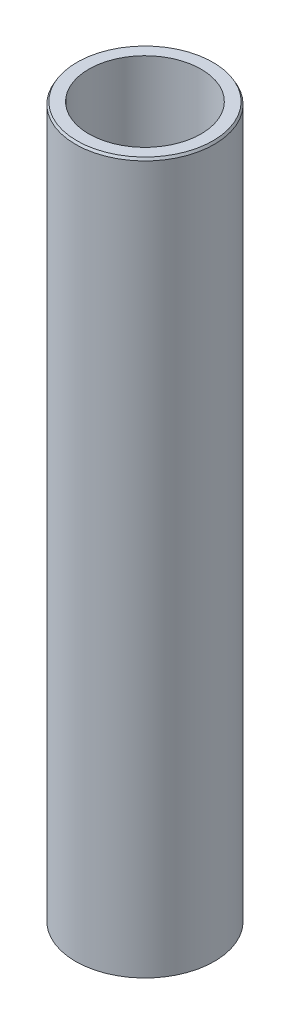
ISO-10303-21;
HEADER;
FILE_DESCRIPTION(('STEP AP214'),'2;1');
FILE_NAME('part.step','',(''),(''),'','','');
FILE_SCHEMA(('AUTOMOTIVE_DESIGN { 1 0 10303 214 1 1 1 1 }'));
ENDSEC;
DATA;
#1=APPLICATION_CONTEXT('core data for automotive mechanical design processes');
#2=APPLICATION_PROTOCOL_DEFINITION('international standard','automotive_design',2000,#1);
#3=PRODUCT_CONTEXT('',#1,'mechanical');
#4=PRODUCT('Part','Part','',(#3));
#5=PRODUCT_RELATED_PRODUCT_CATEGORY('part','',(#4));
#6=PRODUCT_DEFINITION_FORMATION('','',#4);
#7=PRODUCT_DEFINITION_CONTEXT('part definition',#1,'design');
#8=PRODUCT_DEFINITION('design','',#6,#7);
#9=PRODUCT_DEFINITION_SHAPE('','',#8);
#10=(LENGTH_UNIT() NAMED_UNIT(*) SI_UNIT(.MILLI.,.METRE.));
#11=(NAMED_UNIT(*) PLANE_ANGLE_UNIT() SI_UNIT($,.RADIAN.));
#12=(NAMED_UNIT(*) SI_UNIT($,.STERADIAN.) SOLID_ANGLE_UNIT());
#13=UNCERTAINTY_MEASURE_WITH_UNIT(LENGTH_MEASURE(1.E-05),#10,'distance_accuracy_value','');
#14=(GEOMETRIC_REPRESENTATION_CONTEXT(3) GLOBAL_UNCERTAINTY_ASSIGNED_CONTEXT((#13)) GLOBAL_UNIT_ASSIGNED_CONTEXT((#10,
#11,#12)) REPRESENTATION_CONTEXT('',''));
#15=CARTESIAN_POINT('',(0.,0.,0.));
#16=DIRECTION('',(0.,0.,1.));
#17=DIRECTION('',(1.,0.,0.));
#18=AXIS2_PLACEMENT_3D('',#15,#16,#17);
#19=CARTESIAN_POINT('',(0.,589.368917905681,0.));
#20=DIRECTION('',(0.,-1.,0.));
#21=DIRECTION('',(0.,0.,-1.));
#22=AXIS2_PLACEMENT_3D('',#19,#20,#21);
#23=CYLINDRICAL_SURFACE('',#22,57.5);
#24=CARTESIAN_POINT('',(0.,587.380637250422,0.));
#25=DIRECTION('',(0.,1.,0.));
#26=DIRECTION('',(0.,0.,1.));
#27=AXIS2_PLACEMENT_3D('',#24,#25,#26);
#28=CIRCLE('',#27,57.5);
#29=CARTESIAN_POINT('',(0.,587.380637250422,57.5));
#30=VERTEX_POINT('',#29);
#31=EDGE_CURVE('E50',#30,#30,#28,.F.);
#32=ORIENTED_EDGE('',*,*,#31,.T.);
#33=EDGE_LOOP('',(#32));
#34=FACE_BOUND('',#33,.T.);
#35=CARTESIAN_POINT('',(0.,1.14793437153782,0.));
#36=DIRECTION('',(0.,1.,0.));
#37=DIRECTION('',(0.,0.,1.));
#38=AXIS2_PLACEMENT_3D('',#35,#36,#37);
#39=CIRCLE('',#38,57.5);
#40=CARTESIAN_POINT('',(0.,1.14793437153782,57.5));
#41=VERTEX_POINT('',#40);
#42=EDGE_CURVE('E51',#41,#41,#39,.T.);
#43=ORIENTED_EDGE('',*,*,#42,.T.);
#44=EDGE_LOOP('',(#43));
#45=FACE_BOUND('',#44,.T.);
#46=ADVANCED_FACE('F39',(#34,#45),#23,.T.);
#47=CARTESIAN_POINT('',(0.,589.368917905681,0.));
#48=DIRECTION('',(0.,1.,0.));
#49=DIRECTION('',(0.,0.,1.));
#50=AXIS2_PLACEMENT_3D('',#47,#48,#49);
#51=PLANE('',#50);
#52=CARTESIAN_POINT('',(0.,589.368917905681,0.));
#53=DIRECTION('',(0.,1.,0.));
#54=DIRECTION('',(0.,0.,1.));
#55=AXIS2_PLACEMENT_3D('',#52,#53,#54);
#56=CIRCLE('',#55,56.352065628462);
#57=CARTESIAN_POINT('',(0.,589.368917905681,56.352065628462));
#58=VERTEX_POINT('',#57);
#59=EDGE_CURVE('E54',#58,#58,#56,.T.);
#60=ORIENTED_EDGE('',*,*,#59,.T.);
#61=EDGE_LOOP('',(#60));
#62=FACE_BOUND('',#61,.T.);
#63=CARTESIAN_POINT('',(0.,589.368917905681,0.));
#64=DIRECTION('',(0.,1.,0.));
#65=DIRECTION('',(0.,0.,1.));
#66=AXIS2_PLACEMENT_3D('',#63,#64,#65);
#67=CIRCLE('',#66,46.5204290078805);
#68=CARTESIAN_POINT('',(0.,589.368917905681,46.5204290078805));
#69=VERTEX_POINT('',#68);
#70=EDGE_CURVE('E58',#69,#69,#67,.T.);
#71=ORIENTED_EDGE('',*,*,#70,.F.);
#72=EDGE_LOOP('',(#71));
#73=FACE_BOUND('',#72,.T.);
#74=ADVANCED_FACE('F69',(#62,#73),#51,.T.);
#75=CARTESIAN_POINT('',(0.,0.,0.));
#76=DIRECTION('',(0.,1.,0.));
#77=DIRECTION('',(0.,0.,1.));
#78=AXIS2_PLACEMENT_3D('',#75,#76,#77);
#79=PLANE('',#78);
#80=CARTESIAN_POINT('',(0.,0.,0.));
#81=DIRECTION('',(0.,1.,0.));
#82=DIRECTION('',(0.,0.,1.));
#83=AXIS2_PLACEMENT_3D('',#80,#81,#82);
#84=CIRCLE('',#83,55.5117193447418);
#85=CARTESIAN_POINT('',(0.,0.,55.5117193447418));
#86=VERTEX_POINT('',#85);
#87=EDGE_CURVE('E10',#86,#86,#84,.F.);
#88=ORIENTED_EDGE('',*,*,#87,.T.);
#89=EDGE_LOOP('',(#88));
#90=FACE_BOUND('',#89,.T.);
#91=CARTESIAN_POINT('',(0.,0.,0.));
#92=DIRECTION('',(0.,1.,0.));
#93=DIRECTION('',(0.,0.,1.));
#94=AXIS2_PLACEMENT_3D('',#91,#92,#93);
#95=CIRCLE('',#94,46.5204290078805);
#96=CARTESIAN_POINT('',(0.,0.,46.5204290078805));
#97=VERTEX_POINT('',#96);
#98=EDGE_CURVE('E63',#97,#97,#95,.T.);
#99=ORIENTED_EDGE('',*,*,#98,.T.);
#100=EDGE_LOOP('',(#99));
#101=FACE_BOUND('',#100,.T.);
#102=ADVANCED_FACE('F75',(#90,#101),#79,.F.);
#103=CARTESIAN_POINT('',(0.,589.368917905681,0.));
#104=DIRECTION('',(0.,-1.,0.));
#105=DIRECTION('',(0.,0.,-1.));
#106=AXIS2_PLACEMENT_3D('',#103,#104,#105);
#107=CYLINDRICAL_SURFACE('',#106,46.5204290078805);
#108=ORIENTED_EDGE('',*,*,#70,.T.);
#109=EDGE_LOOP('',(#108));
#110=FACE_BOUND('',#109,.T.);
#111=ORIENTED_EDGE('',*,*,#98,.F.);
#112=EDGE_LOOP('',(#111));
#113=FACE_BOUND('',#112,.T.);
#114=ADVANCED_FACE('F70',(#110,#113),#107,.F.);
#115=CARTESIAN_POINT('',(0.,589.368917905681,0.));
#116=DIRECTION('',(0.,-1.,0.));
#117=DIRECTION('',(0.,0.,-1.));
#118=AXIS2_PLACEMENT_3D('',#115,#116,#117);
#119=CONICAL_SURFACE('',#118,56.352065628462,0.523598775598295);
#120=ORIENTED_EDGE('',*,*,#31,.F.);
#121=EDGE_LOOP('',(#120));
#122=FACE_BOUND('',#121,.T.);
#123=ORIENTED_EDGE('',*,*,#59,.F.);
#124=EDGE_LOOP('',(#123));
#125=FACE_BOUND('',#124,.T.);
#126=ADVANCED_FACE('F81',(#122,#125),#119,.T.);
#127=CARTESIAN_POINT('',(0.,1.14793437153782,0.));
#128=DIRECTION('',(0.,1.,0.));
#129=DIRECTION('',(0.,0.,1.));
#130=AXIS2_PLACEMENT_3D('',#127,#128,#129);
#131=CONICAL_SURFACE('',#130,57.5,1.04719755119661);
#132=ORIENTED_EDGE('',*,*,#87,.F.);
#133=EDGE_LOOP('',(#132));
#134=FACE_BOUND('',#133,.T.);
#135=ORIENTED_EDGE('',*,*,#42,.F.);
#136=EDGE_LOOP('',(#135));
#137=FACE_BOUND('',#136,.T.);
#138=ADVANCED_FACE('F45',(#134,#137),#131,.T.);
#139=CLOSED_SHELL('',(#46,#74,#102,#114,#126,#138));
#140=MANIFOLD_SOLID_BREP('B2',#139);
#141=ADVANCED_BREP_SHAPE_REPRESENTATION('',(#18,#140),#14);
#142=SHAPE_DEFINITION_REPRESENTATION(#9,#141);
ENDSEC;
END-ISO-10303-21;
